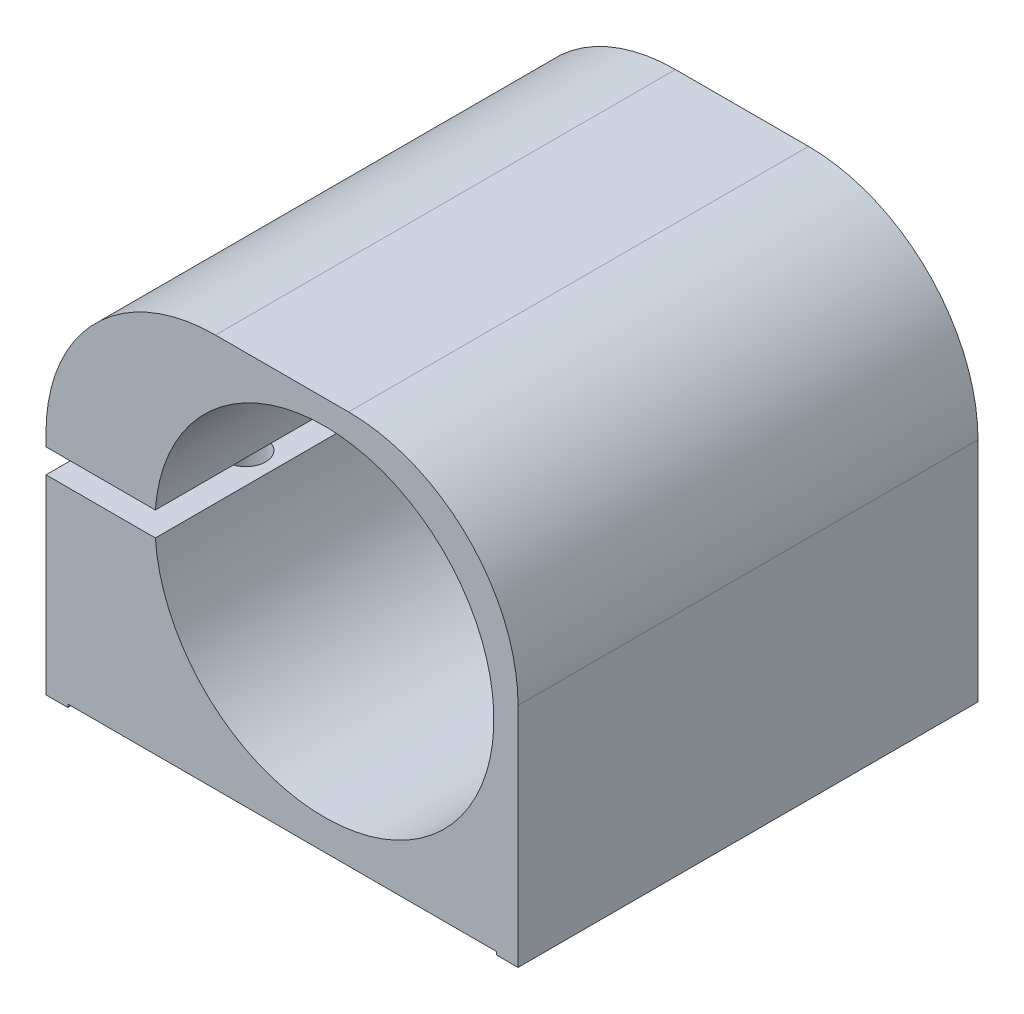
ISO-10303-21;
HEADER;
FILE_DESCRIPTION(('STEP AP214'),'2;1');
FILE_NAME('part.step','',(''),(''),'','','');
FILE_SCHEMA(('AUTOMOTIVE_DESIGN { 1 0 10303 214 1 1 1 1 }'));
ENDSEC;
DATA;
#1=APPLICATION_CONTEXT('core data for automotive mechanical design processes');
#2=APPLICATION_PROTOCOL_DEFINITION('international standard','automotive_design',2000,#1);
#3=PRODUCT_CONTEXT('',#1,'mechanical');
#4=PRODUCT('Part','Part','',(#3));
#5=PRODUCT_RELATED_PRODUCT_CATEGORY('part','',(#4));
#6=PRODUCT_DEFINITION_FORMATION('','',#4);
#7=PRODUCT_DEFINITION_CONTEXT('part definition',#1,'design');
#8=PRODUCT_DEFINITION('design','',#6,#7);
#9=PRODUCT_DEFINITION_SHAPE('','',#8);
#10=(LENGTH_UNIT() NAMED_UNIT(*) SI_UNIT(.MILLI.,.METRE.));
#11=(NAMED_UNIT(*) PLANE_ANGLE_UNIT() SI_UNIT($,.RADIAN.));
#12=(NAMED_UNIT(*) SI_UNIT($,.STERADIAN.) SOLID_ANGLE_UNIT());
#13=UNCERTAINTY_MEASURE_WITH_UNIT(LENGTH_MEASURE(1.E-05),#10,'distance_accuracy_value','');
#14=(GEOMETRIC_REPRESENTATION_CONTEXT(3) GLOBAL_UNCERTAINTY_ASSIGNED_CONTEXT((#13)) GLOBAL_UNIT_ASSIGNED_CONTEXT((#10,
#11,#12)) REPRESENTATION_CONTEXT('',''));
#15=CARTESIAN_POINT('',(0.,0.,0.));
#16=DIRECTION('',(0.,0.,1.));
#17=DIRECTION('',(1.,0.,0.));
#18=AXIS2_PLACEMENT_3D('',#15,#16,#17);
#19=CARTESIAN_POINT('',(-23.,0.,19.));
#20=DIRECTION('',(1.,0.,0.));
#21=DIRECTION('',(0.,1.,0.));
#22=AXIS2_PLACEMENT_3D('',#19,#20,#21);
#23=PLANE('',#22);
#24=DIRECTION('',(0.,0.,-1.));
#25=VECTOR('',#24,1.);
#26=CARTESIAN_POINT('',(-23.,-16.75,19.));
#27=LINE('',#26,#25);
#28=CARTESIAN_POINT('',(-23.,-16.75,19.));
#29=VERTEX_POINT('',#28);
#30=CARTESIAN_POINT('',(-23.,-16.75,-19.));
#31=VERTEX_POINT('',#30);
#32=EDGE_CURVE('E365',#29,#31,#27,.T.);
#33=ORIENTED_EDGE('',*,*,#32,.F.);
#34=DIRECTION('',(0.,-1.,0.));
#35=VECTOR('',#34,1.);
#36=CARTESIAN_POINT('',(-23.,0.,19.));
#37=LINE('',#36,#35);
#38=CARTESIAN_POINT('',(-23.,-1.,19.));
#39=VERTEX_POINT('',#38);
#40=EDGE_CURVE('E262',#39,#29,#37,.T.);
#41=ORIENTED_EDGE('',*,*,#40,.F.);
#42=DIRECTION('',(0.,0.,-1.));
#43=VECTOR('',#42,1.);
#44=CARTESIAN_POINT('',(-23.,-1.,19.));
#45=LINE('',#44,#43);
#46=CARTESIAN_POINT('',(-23.,-1.,-19.));
#47=VERTEX_POINT('',#46);
#48=EDGE_CURVE('E314',#39,#47,#45,.T.);
#49=ORIENTED_EDGE('',*,*,#48,.T.);
#50=DIRECTION('',(0.,-1.,0.));
#51=VECTOR('',#50,1.);
#52=CARTESIAN_POINT('',(-23.,0.,-19.));
#53=LINE('',#52,#51);
#54=EDGE_CURVE('E291',#47,#31,#53,.T.);
#55=ORIENTED_EDGE('',*,*,#54,.T.);
#56=EDGE_LOOP('',(#33,#41,#49,#55));
#57=FACE_BOUND('',#56,.T.);
#58=ADVANCED_FACE('F46',(#57),#23,.F.);
#59=CARTESIAN_POINT('',(16.,0.,19.));
#60=DIRECTION('',(-1.,0.,0.));
#61=DIRECTION('',(0.,-1.,0.));
#62=AXIS2_PLACEMENT_3D('',#59,#60,#61);
#63=PLANE('',#62);
#64=DIRECTION('',(0.,0.,1.));
#65=VECTOR('',#64,1.);
#66=CARTESIAN_POINT('',(16.,-16.75,19.));
#67=LINE('',#66,#65);
#68=CARTESIAN_POINT('',(16.,-16.75,-19.));
#69=VERTEX_POINT('',#68);
#70=CARTESIAN_POINT('',(16.,-16.75,19.));
#71=VERTEX_POINT('',#70);
#72=EDGE_CURVE('E372',#69,#71,#67,.T.);
#73=ORIENTED_EDGE('',*,*,#72,.F.);
#74=DIRECTION('',(0.,1.,0.));
#75=VECTOR('',#74,1.);
#76=CARTESIAN_POINT('',(16.,0.,-19.));
#77=LINE('',#76,#75);
#78=CARTESIAN_POINT('',(16.,2.,-19.));
#79=VERTEX_POINT('',#78);
#80=EDGE_CURVE('E173',#69,#79,#77,.T.);
#81=ORIENTED_EDGE('',*,*,#80,.T.);
#82=DIRECTION('',(0.,0.,-1.));
#83=VECTOR('',#82,1.);
#84=CARTESIAN_POINT('',(16.,2.,19.));
#85=LINE('',#84,#83);
#86=CARTESIAN_POINT('',(16.,2.,19.));
#87=VERTEX_POINT('',#86);
#88=EDGE_CURVE('E310',#87,#79,#85,.T.);
#89=ORIENTED_EDGE('',*,*,#88,.F.);
#90=DIRECTION('',(0.,1.,0.));
#91=VECTOR('',#90,1.);
#92=CARTESIAN_POINT('',(16.,0.,19.));
#93=LINE('',#92,#91);
#94=EDGE_CURVE('E273',#71,#87,#93,.T.);
#95=ORIENTED_EDGE('',*,*,#94,.F.);
#96=EDGE_LOOP('',(#73,#81,#89,#95));
#97=FACE_BOUND('',#96,.T.);
#98=ADVANCED_FACE('F423',(#97),#63,.F.);
#99=CARTESIAN_POINT('',(0.,0.,19.));
#100=DIRECTION('',(0.,0.,1.));
#101=DIRECTION('',(1.,0.,0.));
#102=AXIS2_PLACEMENT_3D('',#99,#100,#101);
#103=PLANE('',#102);
#104=ORIENTED_EDGE('',*,*,#40,.T.);
#105=DIRECTION('',(1.,0.,0.));
#106=VECTOR('',#105,1.);
#107=CARTESIAN_POINT('',(0.,-16.75,19.));
#108=LINE('',#107,#106);
#109=CARTESIAN_POINT('',(-21.2,-16.75,19.));
#110=VERTEX_POINT('',#109);
#111=EDGE_CURVE('E368',#29,#110,#108,.T.);
#112=ORIENTED_EDGE('',*,*,#111,.T.);
#113=DIRECTION('',(0.,-1.,0.));
#114=VECTOR('',#113,1.);
#115=CARTESIAN_POINT('',(-21.2,-16.5,19.));
#116=LINE('',#115,#114);
#117=CARTESIAN_POINT('',(-21.2,-16.5,19.));
#118=VERTEX_POINT('',#117);
#119=EDGE_CURVE('E186',#118,#110,#116,.T.);
#120=ORIENTED_EDGE('',*,*,#119,.F.);
#121=DIRECTION('',(-1.,0.,0.));
#122=VECTOR('',#121,1.);
#123=CARTESIAN_POINT('',(-21.2,-16.5,19.));
#124=LINE('',#123,#122);
#125=CARTESIAN_POINT('',(14.2,-16.5,19.));
#126=VERTEX_POINT('',#125);
#127=EDGE_CURVE('E189',#126,#118,#124,.T.);
#128=ORIENTED_EDGE('',*,*,#127,.F.);
#129=DIRECTION('',(0.,-1.,0.));
#130=VECTOR('',#129,1.);
#131=CARTESIAN_POINT('',(14.2,-16.5,19.));
#132=LINE('',#131,#130);
#133=CARTESIAN_POINT('',(14.2,-16.75,19.));
#134=VERTEX_POINT('',#133);
#135=EDGE_CURVE('E181',#126,#134,#132,.T.);
#136=ORIENTED_EDGE('',*,*,#135,.T.);
#137=EDGE_CURVE('E69',#134,#71,#108,.T.);
#138=ORIENTED_EDGE('',*,*,#137,.T.);
#139=ORIENTED_EDGE('',*,*,#94,.T.);
#140=CARTESIAN_POINT('',(2.,2.,19.));
#141=DIRECTION('',(0.,0.,1.));
#142=DIRECTION('',(1.,0.,0.));
#143=AXIS2_PLACEMENT_3D('',#140,#141,#142);
#144=CIRCLE('',#143,14.);
#145=CARTESIAN_POINT('',(2.,16.,19.));
#146=VERTEX_POINT('',#145);
#147=EDGE_CURVE('E276',#87,#146,#144,.T.);
#148=ORIENTED_EDGE('',*,*,#147,.T.);
#149=DIRECTION('',(-1.,0.,0.));
#150=VECTOR('',#149,1.);
#151=CARTESIAN_POINT('',(0.,16.,19.));
#152=LINE('',#151,#150);
#153=CARTESIAN_POINT('',(-9.,16.,19.));
#154=VERTEX_POINT('',#153);
#155=EDGE_CURVE('E250',#146,#154,#152,.T.);
#156=ORIENTED_EDGE('',*,*,#155,.T.);
#157=CARTESIAN_POINT('',(-9.,2.,19.));
#158=DIRECTION('',(0.,0.,1.));
#159=DIRECTION('',(1.,0.,0.));
#160=AXIS2_PLACEMENT_3D('',#157,#158,#159);
#161=CIRCLE('',#160,14.);
#162=CARTESIAN_POINT('',(-23.,2.,19.));
#163=VERTEX_POINT('',#162);
#164=EDGE_CURVE('E254',#154,#163,#161,.T.);
#165=ORIENTED_EDGE('',*,*,#164,.T.);
#166=CARTESIAN_POINT('',(-23.,1.,19.));
#167=VERTEX_POINT('',#166);
#168=EDGE_CURVE('E258',#163,#167,#37,.T.);
#169=ORIENTED_EDGE('',*,*,#168,.T.);
#170=DIRECTION('',(1.,0.,0.));
#171=VECTOR('',#170,1.);
#172=CARTESIAN_POINT('',(0.,1.,19.));
#173=LINE('',#172,#171);
#174=CARTESIAN_POINT('',(-13.9642400437689,1.,19.));
#175=VERTEX_POINT('',#174);
#176=EDGE_CURVE('E261',#167,#175,#173,.T.);
#177=ORIENTED_EDGE('',*,*,#176,.T.);
#178=CARTESIAN_POINT('',(0.,0.,19.));
#179=DIRECTION('',(0.,0.,1.));
#180=DIRECTION('',(1.,0.,0.));
#181=AXIS2_PLACEMENT_3D('',#178,#179,#180);
#182=CIRCLE('',#181,14.);
#183=CARTESIAN_POINT('',(-13.9642400437689,-1.,19.));
#184=VERTEX_POINT('',#183);
#185=EDGE_CURVE('E265',#184,#175,#182,.T.);
#186=ORIENTED_EDGE('',*,*,#185,.F.);
#187=DIRECTION('',(1.,0.,0.));
#188=VECTOR('',#187,1.);
#189=CARTESIAN_POINT('',(0.,-1.,19.));
#190=LINE('',#189,#188);
#191=EDGE_CURVE('E269',#39,#184,#190,.T.);
#192=ORIENTED_EDGE('',*,*,#191,.F.);
#193=EDGE_LOOP('',(#104,#112,#120,#128,#136,#138,#139,#148,#156,#165,#169,#177,#186,#192));
#194=FACE_BOUND('',#193,.T.);
#195=ADVANCED_FACE('F382',(#194),#103,.T.);
#196=CARTESIAN_POINT('',(0.,0.,-19.));
#197=DIRECTION('',(0.,0.,1.));
#198=DIRECTION('',(1.,0.,0.));
#199=AXIS2_PLACEMENT_3D('',#196,#197,#198);
#200=PLANE('',#199);
#201=DIRECTION('',(1.,0.,0.));
#202=VECTOR('',#201,1.);
#203=CARTESIAN_POINT('',(0.,-16.75,-19.));
#204=LINE('',#203,#202);
#205=CARTESIAN_POINT('',(-21.2,-16.75,-19.));
#206=VERTEX_POINT('',#205);
#207=EDGE_CURVE('E62',#31,#206,#204,.T.);
#208=ORIENTED_EDGE('',*,*,#207,.F.);
#209=ORIENTED_EDGE('',*,*,#54,.F.);
#210=DIRECTION('',(1.,0.,0.));
#211=VECTOR('',#210,1.);
#212=CARTESIAN_POINT('',(0.,-1.,-19.));
#213=LINE('',#212,#211);
#214=CARTESIAN_POINT('',(-13.9642400437689,-1.,-19.));
#215=VERTEX_POINT('',#214);
#216=EDGE_CURVE('E299',#47,#215,#213,.T.);
#217=ORIENTED_EDGE('',*,*,#216,.T.);
#218=CARTESIAN_POINT('',(0.,0.,-19.));
#219=DIRECTION('',(0.,0.,1.));
#220=DIRECTION('',(1.,0.,0.));
#221=AXIS2_PLACEMENT_3D('',#218,#219,#220);
#222=CIRCLE('',#221,14.);
#223=CARTESIAN_POINT('',(-13.9642400437689,1.,-19.));
#224=VERTEX_POINT('',#223);
#225=EDGE_CURVE('E295',#215,#224,#222,.T.);
#226=ORIENTED_EDGE('',*,*,#225,.T.);
#227=DIRECTION('',(1.,0.,0.));
#228=VECTOR('',#227,1.);
#229=CARTESIAN_POINT('',(0.,1.,-19.));
#230=LINE('',#229,#228);
#231=CARTESIAN_POINT('',(-23.,1.,-19.));
#232=VERTEX_POINT('',#231);
#233=EDGE_CURVE('E290',#232,#224,#230,.T.);
#234=ORIENTED_EDGE('',*,*,#233,.F.);
#235=CARTESIAN_POINT('',(-23.,2.,-19.));
#236=VERTEX_POINT('',#235);
#237=EDGE_CURVE('E287',#236,#232,#53,.T.);
#238=ORIENTED_EDGE('',*,*,#237,.F.);
#239=CARTESIAN_POINT('',(-9.,2.,-19.));
#240=DIRECTION('',(0.,0.,1.));
#241=DIRECTION('',(1.,0.,0.));
#242=AXIS2_PLACEMENT_3D('',#239,#240,#241);
#243=CIRCLE('',#242,14.);
#244=CARTESIAN_POINT('',(-9.,16.,-19.));
#245=VERTEX_POINT('',#244);
#246=EDGE_CURVE('E284',#245,#236,#243,.T.);
#247=ORIENTED_EDGE('',*,*,#246,.F.);
#248=DIRECTION('',(-1.,0.,0.));
#249=VECTOR('',#248,1.);
#250=CARTESIAN_POINT('',(0.,16.,-19.));
#251=LINE('',#250,#249);
#252=CARTESIAN_POINT('',(2.,16.,-19.));
#253=VERTEX_POINT('',#252);
#254=EDGE_CURVE('E280',#253,#245,#251,.T.);
#255=ORIENTED_EDGE('',*,*,#254,.F.);
#256=CARTESIAN_POINT('',(2.,2.,-19.));
#257=DIRECTION('',(0.,0.,1.));
#258=DIRECTION('',(1.,0.,0.));
#259=AXIS2_PLACEMENT_3D('',#256,#257,#258);
#260=CIRCLE('',#259,14.);
#261=EDGE_CURVE('E255',#79,#253,#260,.T.);
#262=ORIENTED_EDGE('',*,*,#261,.F.);
#263=ORIENTED_EDGE('',*,*,#80,.F.);
#264=CARTESIAN_POINT('',(14.2,-16.75,-19.));
#265=VERTEX_POINT('',#264);
#266=EDGE_CURVE('E161',#265,#69,#204,.T.);
#267=ORIENTED_EDGE('',*,*,#266,.F.);
#268=DIRECTION('',(0.,-1.,0.));
#269=VECTOR('',#268,1.);
#270=CARTESIAN_POINT('',(14.2,-16.5,-19.));
#271=LINE('',#270,#269);
#272=CARTESIAN_POINT('',(14.2,-16.5,-19.));
#273=VERTEX_POINT('',#272);
#274=EDGE_CURVE('E171',#273,#265,#271,.T.);
#275=ORIENTED_EDGE('',*,*,#274,.F.);
#276=DIRECTION('',(1.,0.,0.));
#277=VECTOR('',#276,1.);
#278=CARTESIAN_POINT('',(-21.2,-16.5,-19.));
#279=LINE('',#278,#277);
#280=CARTESIAN_POINT('',(-21.2,-16.5,-19.));
#281=VERTEX_POINT('',#280);
#282=EDGE_CURVE('E359',#281,#273,#279,.T.);
#283=ORIENTED_EDGE('',*,*,#282,.F.);
#284=DIRECTION('',(0.,-1.,0.));
#285=VECTOR('',#284,1.);
#286=CARTESIAN_POINT('',(-21.2,-16.5,-19.));
#287=LINE('',#286,#285);
#288=EDGE_CURVE('E182',#281,#206,#287,.T.);
#289=ORIENTED_EDGE('',*,*,#288,.T.);
#290=EDGE_LOOP('',(#208,#209,#217,#226,#234,#238,#247,#255,#262,#263,#267,#275,#283,#289));
#291=FACE_BOUND('',#290,.T.);
#292=ADVANCED_FACE('F169',(#291),#200,.F.);
#293=CARTESIAN_POINT('',(-21.2,-16.5,19.));
#294=DIRECTION('',(-1.,0.,0.));
#295=DIRECTION('',(0.,0.,1.));
#296=AXIS2_PLACEMENT_3D('',#293,#294,#295);
#297=PLANE('',#296);
#298=DIRECTION('',(0.,0.,1.));
#299=VECTOR('',#298,1.);
#300=CARTESIAN_POINT('',(-21.2,-16.75,19.));
#301=LINE('',#300,#299);
#302=EDGE_CURVE('E369',#206,#110,#301,.T.);
#303=ORIENTED_EDGE('',*,*,#302,.F.);
#304=ORIENTED_EDGE('',*,*,#288,.F.);
#305=DIRECTION('',(0.,0.,-1.));
#306=VECTOR('',#305,1.);
#307=CARTESIAN_POINT('',(-21.2,-16.5,19.));
#308=LINE('',#307,#306);
#309=EDGE_CURVE('E362',#118,#281,#308,.T.);
#310=ORIENTED_EDGE('',*,*,#309,.F.);
#311=ORIENTED_EDGE('',*,*,#119,.T.);
#312=EDGE_LOOP('',(#303,#304,#310,#311));
#313=FACE_BOUND('',#312,.T.);
#314=ADVANCED_FACE('F474',(#313),#297,.F.);
#315=CARTESIAN_POINT('',(14.2,-16.5,19.));
#316=DIRECTION('',(1.,0.,0.));
#317=DIRECTION('',(0.,0.,-1.));
#318=AXIS2_PLACEMENT_3D('',#315,#316,#317);
#319=PLANE('',#318);
#320=DIRECTION('',(0.,0.,-1.));
#321=VECTOR('',#320,1.);
#322=CARTESIAN_POINT('',(14.2,-16.75,19.));
#323=LINE('',#322,#321);
#324=EDGE_CURVE('E12',#134,#265,#323,.T.);
#325=ORIENTED_EDGE('',*,*,#324,.F.);
#326=ORIENTED_EDGE('',*,*,#135,.F.);
#327=DIRECTION('',(0.,0.,1.));
#328=VECTOR('',#327,1.);
#329=CARTESIAN_POINT('',(14.2,-16.5,19.));
#330=LINE('',#329,#328);
#331=EDGE_CURVE('E178',#273,#126,#330,.T.);
#332=ORIENTED_EDGE('',*,*,#331,.F.);
#333=ORIENTED_EDGE('',*,*,#274,.T.);
#334=EDGE_LOOP('',(#325,#326,#332,#333));
#335=FACE_BOUND('',#334,.T.);
#336=ADVANCED_FACE('F176',(#335),#319,.F.);
#337=CARTESIAN_POINT('',(-16.5,-17.,9.));
#338=DIRECTION('',(0.,-1.,0.));
#339=DIRECTION('',(0.,0.,-1.));
#340=AXIS2_PLACEMENT_3D('',#337,#338,#339);
#341=CYLINDRICAL_SURFACE('',#340,3.25);
#342=CARTESIAN_POINT('',(-16.5,-13.6,9.));
#343=DIRECTION('',(0.,-1.,0.));
#344=DIRECTION('',(0.,0.,-1.));
#345=AXIS2_PLACEMENT_3D('',#342,#343,#344);
#346=CIRCLE('',#345,3.25);
#347=CARTESIAN_POINT('',(-16.5,-13.6,5.75));
#348=VERTEX_POINT('',#347);
#349=EDGE_CURVE('E245',#348,#348,#346,.T.);
#350=ORIENTED_EDGE('',*,*,#349,.F.);
#351=EDGE_LOOP('',(#350));
#352=FACE_BOUND('',#351,.T.);
#353=CARTESIAN_POINT('',(-16.5,-16.5,9.));
#354=DIRECTION('',(0.,-1.,0.));
#355=DIRECTION('',(0.,0.,-1.));
#356=AXIS2_PLACEMENT_3D('',#353,#354,#355);
#357=CIRCLE('',#356,3.25);
#358=CARTESIAN_POINT('',(-16.5,-16.5,5.75));
#359=VERTEX_POINT('',#358);
#360=EDGE_CURVE('E206',#359,#359,#357,.F.);
#361=ORIENTED_EDGE('',*,*,#360,.F.);
#362=EDGE_LOOP('',(#361));
#363=FACE_BOUND('',#362,.T.);
#364=ADVANCED_FACE('F451',(#352,#363),#341,.F.);
#365=CARTESIAN_POINT('',(-16.5,-17.,-9.));
#366=DIRECTION('',(0.,-1.,0.));
#367=DIRECTION('',(0.,0.,-1.));
#368=AXIS2_PLACEMENT_3D('',#365,#366,#367);
#369=CYLINDRICAL_SURFACE('',#368,3.25);
#370=CARTESIAN_POINT('',(-16.5,-13.6,-9.));
#371=DIRECTION('',(0.,-1.,0.));
#372=DIRECTION('',(0.,0.,-1.));
#373=AXIS2_PLACEMENT_3D('',#370,#371,#372);
#374=CIRCLE('',#373,3.25);
#375=CARTESIAN_POINT('',(-16.5,-13.6,-12.25));
#376=VERTEX_POINT('',#375);
#377=EDGE_CURVE('E236',#376,#376,#374,.T.);
#378=ORIENTED_EDGE('',*,*,#377,.F.);
#379=EDGE_LOOP('',(#378));
#380=FACE_BOUND('',#379,.T.);
#381=CARTESIAN_POINT('',(-16.5,-16.5,-9.));
#382=DIRECTION('',(0.,-1.,0.));
#383=DIRECTION('',(0.,0.,-1.));
#384=AXIS2_PLACEMENT_3D('',#381,#382,#383);
#385=CIRCLE('',#384,3.25);
#386=CARTESIAN_POINT('',(-16.5,-16.5,-12.25));
#387=VERTEX_POINT('',#386);
#388=EDGE_CURVE('E202',#387,#387,#385,.F.);
#389=ORIENTED_EDGE('',*,*,#388,.F.);
#390=EDGE_LOOP('',(#389));
#391=FACE_BOUND('',#390,.T.);
#392=ADVANCED_FACE('F447',(#380,#391),#369,.F.);
#393=CARTESIAN_POINT('',(0.,16.,19.));
#394=DIRECTION('',(0.,-1.,0.));
#395=DIRECTION('',(0.,0.,-1.));
#396=AXIS2_PLACEMENT_3D('',#393,#394,#395);
#397=PLANE('',#396);
#398=ORIENTED_EDGE('',*,*,#254,.T.);
#399=DIRECTION('',(0.,0.,-1.));
#400=VECTOR('',#399,1.);
#401=CARTESIAN_POINT('',(-9.,16.,19.));
#402=LINE('',#401,#400);
#403=EDGE_CURVE('E55',#154,#245,#402,.T.);
#404=ORIENTED_EDGE('',*,*,#403,.F.);
#405=ORIENTED_EDGE('',*,*,#155,.F.);
#406=DIRECTION('',(0.,0.,-1.));
#407=VECTOR('',#406,1.);
#408=CARTESIAN_POINT('',(2.,16.,19.));
#409=LINE('',#408,#407);
#410=EDGE_CURVE('E279',#146,#253,#409,.T.);
#411=ORIENTED_EDGE('',*,*,#410,.T.);
#412=EDGE_LOOP('',(#398,#404,#405,#411));
#413=FACE_BOUND('',#412,.T.);
#414=ADVANCED_FACE('F48',(#413),#397,.F.);
#415=CARTESIAN_POINT('',(-9.,2.,19.));
#416=DIRECTION('',(0.,0.,-1.));
#417=DIRECTION('',(-1.,0.,0.));
#418=AXIS2_PLACEMENT_3D('',#415,#416,#417);
#419=CYLINDRICAL_SURFACE('',#418,14.);
#420=ORIENTED_EDGE('',*,*,#246,.T.);
#421=DIRECTION('',(0.,0.,-1.));
#422=VECTOR('',#421,1.);
#423=CARTESIAN_POINT('',(-23.,2.,19.));
#424=LINE('',#423,#422);
#425=EDGE_CURVE('E327',#163,#236,#424,.T.);
#426=ORIENTED_EDGE('',*,*,#425,.F.);
#427=ORIENTED_EDGE('',*,*,#164,.F.);
#428=ORIENTED_EDGE('',*,*,#403,.T.);
#429=EDGE_LOOP('',(#420,#426,#427,#428));
#430=FACE_BOUND('',#429,.T.);
#431=ADVANCED_FACE('F412',(#430),#419,.T.);
#432=ORIENTED_EDGE('',*,*,#237,.T.);
#433=DIRECTION('',(0.,0.,-1.));
#434=VECTOR('',#433,1.);
#435=CARTESIAN_POINT('',(-23.,1.,19.));
#436=LINE('',#435,#434);
#437=EDGE_CURVE('E323',#167,#232,#436,.T.);
#438=ORIENTED_EDGE('',*,*,#437,.F.);
#439=ORIENTED_EDGE('',*,*,#168,.F.);
#440=ORIENTED_EDGE('',*,*,#425,.T.);
#441=EDGE_LOOP('',(#432,#438,#439,#440));
#442=FACE_BOUND('',#441,.T.);
#443=ADVANCED_FACE('F409',(#442),#23,.F.);
#444=CARTESIAN_POINT('',(0.,1.,19.));
#445=DIRECTION('',(0.,1.,0.));
#446=DIRECTION('',(0.,0.,1.));
#447=AXIS2_PLACEMENT_3D('',#444,#445,#446);
#448=PLANE('',#447);
#449=CARTESIAN_POINT('',(-16.5,1.,-9.));
#450=DIRECTION('',(0.,1.,0.));
#451=DIRECTION('',(0.,0.,1.));
#452=AXIS2_PLACEMENT_3D('',#449,#450,#451);
#453=CIRCLE('',#452,1.25);
#454=CARTESIAN_POINT('',(-16.5,1.,-7.75));
#455=VERTEX_POINT('',#454);
#456=EDGE_CURVE('E226',#455,#455,#453,.T.);
#457=ORIENTED_EDGE('',*,*,#456,.T.);
#458=EDGE_LOOP('',(#457));
#459=FACE_BOUND('',#458,.T.);
#460=CARTESIAN_POINT('',(-16.5,1.,9.));
#461=DIRECTION('',(0.,1.,0.));
#462=DIRECTION('',(0.,0.,1.));
#463=AXIS2_PLACEMENT_3D('',#460,#461,#462);
#464=CIRCLE('',#463,1.25);
#465=CARTESIAN_POINT('',(-16.5,1.,10.25));
#466=VERTEX_POINT('',#465);
#467=EDGE_CURVE('E231',#466,#466,#464,.T.);
#468=ORIENTED_EDGE('',*,*,#467,.T.);
#469=EDGE_LOOP('',(#468));
#470=FACE_BOUND('',#469,.T.);
#471=ORIENTED_EDGE('',*,*,#233,.T.);
#472=DIRECTION('',(0.,0.,-1.));
#473=VECTOR('',#472,1.);
#474=CARTESIAN_POINT('',(-13.9642400437689,1.,19.));
#475=LINE('',#474,#473);
#476=EDGE_CURVE('E320',#175,#224,#475,.T.);
#477=ORIENTED_EDGE('',*,*,#476,.F.);
#478=ORIENTED_EDGE('',*,*,#176,.F.);
#479=ORIENTED_EDGE('',*,*,#437,.T.);
#480=EDGE_LOOP('',(#471,#477,#478,#479));
#481=FACE_BOUND('',#480,.T.);
#482=ADVANCED_FACE('F404',(#459,#470,#481),#448,.F.);
#483=CARTESIAN_POINT('',(0.,0.,19.));
#484=DIRECTION('',(0.,0.,-1.));
#485=DIRECTION('',(-1.,0.,0.));
#486=AXIS2_PLACEMENT_3D('',#483,#484,#485);
#487=CYLINDRICAL_SURFACE('',#486,14.);
#488=ORIENTED_EDGE('',*,*,#225,.F.);
#489=DIRECTION('',(0.,0.,-1.));
#490=VECTOR('',#489,1.);
#491=CARTESIAN_POINT('',(-13.9642400437689,-1.,19.));
#492=LINE('',#491,#490);
#493=EDGE_CURVE('E317',#184,#215,#492,.T.);
#494=ORIENTED_EDGE('',*,*,#493,.F.);
#495=ORIENTED_EDGE('',*,*,#185,.T.);
#496=ORIENTED_EDGE('',*,*,#476,.T.);
#497=EDGE_LOOP('',(#488,#494,#495,#496));
#498=FACE_BOUND('',#497,.T.);
#499=ADVANCED_FACE('F399',(#498),#487,.F.);
#500=CARTESIAN_POINT('',(0.,-1.,19.));
#501=DIRECTION('',(0.,1.,0.));
#502=DIRECTION('',(-1.,0.,0.));
#503=AXIS2_PLACEMENT_3D('',#500,#501,#502);
#504=PLANE('',#503);
#505=CARTESIAN_POINT('',(-16.5,-1.,-9.));
#506=DIRECTION('',(0.,1.,0.));
#507=DIRECTION('',(-1.,0.,0.));
#508=AXIS2_PLACEMENT_3D('',#505,#506,#507);
#509=CIRCLE('',#508,1.65);
#510=CARTESIAN_POINT('',(-18.15,-1.,-9.));
#511=VERTEX_POINT('',#510);
#512=EDGE_CURVE('E240',#511,#511,#509,.T.);
#513=ORIENTED_EDGE('',*,*,#512,.F.);
#514=EDGE_LOOP('',(#513));
#515=FACE_BOUND('',#514,.T.);
#516=CARTESIAN_POINT('',(-16.5,-1.,9.));
#517=DIRECTION('',(0.,1.,0.));
#518=DIRECTION('',(-1.,0.,0.));
#519=AXIS2_PLACEMENT_3D('',#516,#517,#518);
#520=CIRCLE('',#519,1.65);
#521=CARTESIAN_POINT('',(-18.15,-1.,9.));
#522=VERTEX_POINT('',#521);
#523=EDGE_CURVE('E249',#522,#522,#520,.T.);
#524=ORIENTED_EDGE('',*,*,#523,.F.);
#525=EDGE_LOOP('',(#524));
#526=FACE_BOUND('',#525,.T.);
#527=ORIENTED_EDGE('',*,*,#216,.F.);
#528=ORIENTED_EDGE('',*,*,#48,.F.);
#529=ORIENTED_EDGE('',*,*,#191,.T.);
#530=ORIENTED_EDGE('',*,*,#493,.T.);
#531=EDGE_LOOP('',(#527,#528,#529,#530));
#532=FACE_BOUND('',#531,.T.);
#533=ADVANCED_FACE('F395',(#515,#526,#532),#504,.T.);
#534=CARTESIAN_POINT('',(2.,2.,19.));
#535=DIRECTION('',(0.,0.,-1.));
#536=DIRECTION('',(-1.,0.,0.));
#537=AXIS2_PLACEMENT_3D('',#534,#535,#536);
#538=CYLINDRICAL_SURFACE('',#537,14.);
#539=ORIENTED_EDGE('',*,*,#261,.T.);
#540=ORIENTED_EDGE('',*,*,#410,.F.);
#541=ORIENTED_EDGE('',*,*,#147,.F.);
#542=ORIENTED_EDGE('',*,*,#88,.T.);
#543=EDGE_LOOP('',(#539,#540,#541,#542));
#544=FACE_BOUND('',#543,.T.);
#545=ADVANCED_FACE('F420',(#544),#538,.T.);
#546=CARTESIAN_POINT('',(-16.5,-17.,9.));
#547=DIRECTION('',(0.,-1.,0.));
#548=DIRECTION('',(0.,0.,-1.));
#549=AXIS2_PLACEMENT_3D('',#546,#547,#548);
#550=CYLINDRICAL_SURFACE('',#549,1.65);
#551=ORIENTED_EDGE('',*,*,#523,.T.);
#552=EDGE_LOOP('',(#551));
#553=FACE_BOUND('',#552,.T.);
#554=CARTESIAN_POINT('',(-16.5,-13.6,9.));
#555=DIRECTION('',(0.,-1.,0.));
#556=DIRECTION('',(0.,0.,-1.));
#557=AXIS2_PLACEMENT_3D('',#554,#555,#556);
#558=CIRCLE('',#557,1.65);
#559=CARTESIAN_POINT('',(-16.5,-13.6,7.35));
#560=VERTEX_POINT('',#559);
#561=EDGE_CURVE('E241',#560,#560,#558,.T.);
#562=ORIENTED_EDGE('',*,*,#561,.T.);
#563=EDGE_LOOP('',(#562));
#564=FACE_BOUND('',#563,.T.);
#565=ADVANCED_FACE('F465',(#553,#564),#550,.F.);
#566=CARTESIAN_POINT('',(-14.85,-13.6,9.));
#567=DIRECTION('',(0.,1.,0.));
#568=DIRECTION('',(0.,0.,1.));
#569=AXIS2_PLACEMENT_3D('',#566,#567,#568);
#570=PLANE('',#569);
#571=ORIENTED_EDGE('',*,*,#561,.F.);
#572=EDGE_LOOP('',(#571));
#573=FACE_BOUND('',#572,.T.);
#574=ORIENTED_EDGE('',*,*,#349,.T.);
#575=EDGE_LOOP('',(#574));
#576=FACE_BOUND('',#575,.T.);
#577=ADVANCED_FACE('F468',(#573,#576),#570,.F.);
#578=CARTESIAN_POINT('',(-16.5,-17.,-9.));
#579=DIRECTION('',(0.,-1.,0.));
#580=DIRECTION('',(0.,0.,-1.));
#581=AXIS2_PLACEMENT_3D('',#578,#579,#580);
#582=CYLINDRICAL_SURFACE('',#581,1.65);
#583=ORIENTED_EDGE('',*,*,#512,.T.);
#584=EDGE_LOOP('',(#583));
#585=FACE_BOUND('',#584,.T.);
#586=CARTESIAN_POINT('',(-16.5,-13.6,-9.));
#587=DIRECTION('',(0.,-1.,0.));
#588=DIRECTION('',(0.,0.,-1.));
#589=AXIS2_PLACEMENT_3D('',#586,#587,#588);
#590=CIRCLE('',#589,1.65);
#591=CARTESIAN_POINT('',(-16.5,-13.6,-10.65));
#592=VERTEX_POINT('',#591);
#593=EDGE_CURVE('E232',#592,#592,#590,.T.);
#594=ORIENTED_EDGE('',*,*,#593,.T.);
#595=EDGE_LOOP('',(#594));
#596=FACE_BOUND('',#595,.T.);
#597=ADVANCED_FACE('F471',(#585,#596),#582,.F.);
#598=CARTESIAN_POINT('',(-14.85,-13.6,-9.));
#599=DIRECTION('',(0.,1.,0.));
#600=DIRECTION('',(0.,0.,1.));
#601=AXIS2_PLACEMENT_3D('',#598,#599,#600);
#602=PLANE('',#601);
#603=ORIENTED_EDGE('',*,*,#593,.F.);
#604=EDGE_LOOP('',(#603));
#605=FACE_BOUND('',#604,.T.);
#606=ORIENTED_EDGE('',*,*,#377,.T.);
#607=EDGE_LOOP('',(#606));
#608=FACE_BOUND('',#607,.T.);
#609=ADVANCED_FACE('F463',(#605,#608),#602,.F.);
#610=CARTESIAN_POINT('',(-16.5,-17.,9.));
#611=DIRECTION('',(0.,-1.,0.));
#612=DIRECTION('',(0.,0.,-1.));
#613=AXIS2_PLACEMENT_3D('',#610,#611,#612);
#614=CYLINDRICAL_SURFACE('',#613,1.25);
#615=CARTESIAN_POINT('',(-16.5,11.,9.));
#616=DIRECTION('',(0.,-1.,0.));
#617=DIRECTION('',(0.,0.,-1.));
#618=AXIS2_PLACEMENT_3D('',#615,#616,#617);
#619=CIRCLE('',#618,1.25);
#620=CARTESIAN_POINT('',(-16.5,11.,7.75));
#621=VERTEX_POINT('',#620);
#622=EDGE_CURVE('E227',#621,#621,#619,.T.);
#623=ORIENTED_EDGE('',*,*,#622,.F.);
#624=EDGE_LOOP('',(#623));
#625=FACE_BOUND('',#624,.T.);
#626=ORIENTED_EDGE('',*,*,#467,.F.);
#627=EDGE_LOOP('',(#626));
#628=FACE_BOUND('',#627,.T.);
#629=ADVANCED_FACE('F519',(#625,#628),#614,.F.);
#630=CARTESIAN_POINT('',(-16.5,11.,9.));
#631=DIRECTION('',(0.,-1.,0.));
#632=DIRECTION('',(0.,0.,-1.));
#633=AXIS2_PLACEMENT_3D('',#630,#631,#632);
#634=CONICAL_SURFACE('',#633,1.25,1.02974425867665);
#635=CARTESIAN_POINT('',(-16.5,11.7510757737844,9.));
#636=VERTEX_POINT('',#635);
#637=VERTEX_LOOP('',#636);
#638=FACE_BOUND('',#637,.T.);
#639=ORIENTED_EDGE('',*,*,#622,.T.);
#640=EDGE_LOOP('',(#639));
#641=FACE_BOUND('',#640,.T.);
#642=ADVANCED_FACE('F514',(#638,#641),#634,.F.);
#643=CARTESIAN_POINT('',(-16.5,-17.,-9.));
#644=DIRECTION('',(0.,-1.,0.));
#645=DIRECTION('',(0.,0.,-1.));
#646=AXIS2_PLACEMENT_3D('',#643,#644,#645);
#647=CYLINDRICAL_SURFACE('',#646,1.25);
#648=CARTESIAN_POINT('',(-16.5,11.,-9.));
#649=DIRECTION('',(0.,-1.,0.));
#650=DIRECTION('',(0.,0.,-1.));
#651=AXIS2_PLACEMENT_3D('',#648,#649,#650);
#652=CIRCLE('',#651,1.25);
#653=CARTESIAN_POINT('',(-16.5,11.,-10.25));
#654=VERTEX_POINT('',#653);
#655=EDGE_CURVE('E222',#654,#654,#652,.T.);
#656=ORIENTED_EDGE('',*,*,#655,.F.);
#657=EDGE_LOOP('',(#656));
#658=FACE_BOUND('',#657,.T.);
#659=ORIENTED_EDGE('',*,*,#456,.F.);
#660=EDGE_LOOP('',(#659));
#661=FACE_BOUND('',#660,.T.);
#662=ADVANCED_FACE('F510',(#658,#661),#647,.F.);
#663=CARTESIAN_POINT('',(-16.5,11.,-9.));
#664=DIRECTION('',(0.,-1.,0.));
#665=DIRECTION('',(0.,0.,-1.));
#666=AXIS2_PLACEMENT_3D('',#663,#664,#665);
#667=CONICAL_SURFACE('',#666,1.25,1.02974425867665);
#668=CARTESIAN_POINT('',(-16.5,11.7510757737844,-9.));
#669=VERTEX_POINT('',#668);
#670=VERTEX_LOOP('',#669);
#671=FACE_BOUND('',#670,.T.);
#672=ORIENTED_EDGE('',*,*,#655,.T.);
#673=EDGE_LOOP('',(#672));
#674=FACE_BOUND('',#673,.T.);
#675=ADVANCED_FACE('F513',(#671,#674),#667,.F.);
#676=CARTESIAN_POINT('',(0.,-16.5,0.));
#677=DIRECTION('',(0.,-1.,0.));
#678=DIRECTION('',(0.,0.,-1.));
#679=AXIS2_PLACEMENT_3D('',#676,#677,#678);
#680=PLANE('',#679);
#681=ORIENTED_EDGE('',*,*,#309,.T.);
#682=ORIENTED_EDGE('',*,*,#282,.T.);
#683=ORIENTED_EDGE('',*,*,#331,.T.);
#684=ORIENTED_EDGE('',*,*,#127,.T.);
#685=EDGE_LOOP('',(#681,#682,#683,#684));
#686=FACE_BOUND('',#685,.T.);
#687=CARTESIAN_POINT('',(-12.,-16.5,-14.));
#688=DIRECTION('',(0.,-1.,0.));
#689=DIRECTION('',(0.,0.,-1.));
#690=AXIS2_PLACEMENT_3D('',#687,#688,#689);
#691=CIRCLE('',#690,1.65);
#692=CARTESIAN_POINT('',(-12.,-16.5,-15.65));
#693=VERTEX_POINT('',#692);
#694=EDGE_CURVE('E198',#693,#693,#691,.F.);
#695=ORIENTED_EDGE('',*,*,#694,.T.);
#696=EDGE_LOOP('',(#695));
#697=FACE_BOUND('',#696,.T.);
#698=CARTESIAN_POINT('',(-12.,-16.5,14.));
#699=DIRECTION('',(0.,-1.,0.));
#700=DIRECTION('',(0.,0.,-1.));
#701=AXIS2_PLACEMENT_3D('',#698,#699,#700);
#702=CIRCLE('',#701,1.65);
#703=CARTESIAN_POINT('',(-12.,-16.5,12.35));
#704=VERTEX_POINT('',#703);
#705=EDGE_CURVE('E193',#704,#704,#702,.F.);
#706=ORIENTED_EDGE('',*,*,#705,.T.);
#707=EDGE_LOOP('',(#706));
#708=FACE_BOUND('',#707,.T.);
#709=CARTESIAN_POINT('',(12.,-16.5,0.));
#710=DIRECTION('',(0.,-1.,0.));
#711=DIRECTION('',(0.,0.,-1.));
#712=AXIS2_PLACEMENT_3D('',#709,#710,#711);
#713=CIRCLE('',#712,1.65);
#714=CARTESIAN_POINT('',(12.,-16.5,-1.65));
#715=VERTEX_POINT('',#714);
#716=EDGE_CURVE('E197',#715,#715,#713,.F.);
#717=ORIENTED_EDGE('',*,*,#716,.T.);
#718=EDGE_LOOP('',(#717));
#719=FACE_BOUND('',#718,.T.);
#720=ORIENTED_EDGE('',*,*,#388,.T.);
#721=EDGE_LOOP('',(#720));
#722=FACE_BOUND('',#721,.T.);
#723=ORIENTED_EDGE('',*,*,#360,.T.);
#724=EDGE_LOOP('',(#723));
#725=FACE_BOUND('',#724,.T.);
#726=ADVANCED_FACE('F502',(#686,#697,#708,#719,#722,#725),#680,.T.);
#727=CARTESIAN_POINT('',(-12.,-10.5,14.));
#728=DIRECTION('',(0.,-1.,0.));
#729=DIRECTION('',(0.,0.,-1.));
#730=AXIS2_PLACEMENT_3D('',#727,#728,#729);
#731=CONICAL_SURFACE('',#730,1.65,1.02974425867665);
#732=CARTESIAN_POINT('',(-12.,-9.50857997860453,14.));
#733=VERTEX_POINT('',#732);
#734=VERTEX_LOOP('',#733);
#735=FACE_BOUND('',#734,.T.);
#736=CARTESIAN_POINT('',(-12.,-10.5,14.));
#737=DIRECTION('',(0.,-1.,0.));
#738=DIRECTION('',(0.,0.,-1.));
#739=AXIS2_PLACEMENT_3D('',#736,#737,#738);
#740=CIRCLE('',#739,1.65);
#741=CARTESIAN_POINT('',(-12.,-10.5,12.35));
#742=VERTEX_POINT('',#741);
#743=EDGE_CURVE('E214',#742,#742,#740,.T.);
#744=ORIENTED_EDGE('',*,*,#743,.T.);
#745=EDGE_LOOP('',(#744));
#746=FACE_BOUND('',#745,.T.);
#747=ADVANCED_FACE('F498',(#735,#746),#731,.F.);
#748=CARTESIAN_POINT('',(-12.,-17.,14.));
#749=DIRECTION('',(0.,-1.,0.));
#750=DIRECTION('',(0.,0.,-1.));
#751=AXIS2_PLACEMENT_3D('',#748,#749,#750);
#752=CYLINDRICAL_SURFACE('',#751,1.65);
#753=ORIENTED_EDGE('',*,*,#743,.F.);
#754=EDGE_LOOP('',(#753));
#755=FACE_BOUND('',#754,.T.);
#756=ORIENTED_EDGE('',*,*,#705,.F.);
#757=EDGE_LOOP('',(#756));
#758=FACE_BOUND('',#757,.T.);
#759=ADVANCED_FACE('F494',(#755,#758),#752,.F.);
#760=CARTESIAN_POINT('',(12.,-10.5,0.));
#761=DIRECTION('',(0.,-1.,0.));
#762=DIRECTION('',(0.,0.,-1.));
#763=AXIS2_PLACEMENT_3D('',#760,#761,#762);
#764=CONICAL_SURFACE('',#763,1.65,1.02974425867665);
#765=CARTESIAN_POINT('',(12.,-9.50857997860453,0.));
#766=VERTEX_POINT('',#765);
#767=VERTEX_LOOP('',#766);
#768=FACE_BOUND('',#767,.T.);
#769=CARTESIAN_POINT('',(12.,-10.5,0.));
#770=DIRECTION('',(0.,-1.,0.));
#771=DIRECTION('',(0.,0.,-1.));
#772=AXIS2_PLACEMENT_3D('',#769,#770,#771);
#773=CIRCLE('',#772,1.65);
#774=CARTESIAN_POINT('',(12.,-10.5,-1.65));
#775=VERTEX_POINT('',#774);
#776=EDGE_CURVE('E218',#775,#775,#773,.T.);
#777=ORIENTED_EDGE('',*,*,#776,.T.);
#778=EDGE_LOOP('',(#777));
#779=FACE_BOUND('',#778,.T.);
#780=ADVANCED_FACE('F497',(#768,#779),#764,.F.);
#781=CARTESIAN_POINT('',(12.,-17.,0.));
#782=DIRECTION('',(0.,-1.,0.));
#783=DIRECTION('',(0.,0.,-1.));
#784=AXIS2_PLACEMENT_3D('',#781,#782,#783);
#785=CYLINDRICAL_SURFACE('',#784,1.65);
#786=ORIENTED_EDGE('',*,*,#776,.F.);
#787=EDGE_LOOP('',(#786));
#788=FACE_BOUND('',#787,.T.);
#789=ORIENTED_EDGE('',*,*,#716,.F.);
#790=EDGE_LOOP('',(#789));
#791=FACE_BOUND('',#790,.T.);
#792=ADVANCED_FACE('F492',(#788,#791),#785,.F.);
#793=CARTESIAN_POINT('',(-12.,-10.5,-14.));
#794=DIRECTION('',(0.,-1.,0.));
#795=DIRECTION('',(0.,0.,-1.));
#796=AXIS2_PLACEMENT_3D('',#793,#794,#795);
#797=CONICAL_SURFACE('',#796,1.65,1.02974425867665);
#798=CARTESIAN_POINT('',(-12.,-9.50857997860453,-14.));
#799=VERTEX_POINT('',#798);
#800=VERTEX_LOOP('',#799);
#801=FACE_BOUND('',#800,.T.);
#802=CARTESIAN_POINT('',(-12.,-10.5,-14.));
#803=DIRECTION('',(0.,-1.,0.));
#804=DIRECTION('',(0.,0.,-1.));
#805=AXIS2_PLACEMENT_3D('',#802,#803,#804);
#806=CIRCLE('',#805,1.65);
#807=CARTESIAN_POINT('',(-12.,-10.5,-15.65));
#808=VERTEX_POINT('',#807);
#809=EDGE_CURVE('E210',#808,#808,#806,.T.);
#810=ORIENTED_EDGE('',*,*,#809,.T.);
#811=EDGE_LOOP('',(#810));
#812=FACE_BOUND('',#811,.T.);
#813=ADVANCED_FACE('F488',(#801,#812),#797,.F.);
#814=CARTESIAN_POINT('',(-12.,-17.,-14.));
#815=DIRECTION('',(0.,-1.,0.));
#816=DIRECTION('',(0.,0.,-1.));
#817=AXIS2_PLACEMENT_3D('',#814,#815,#816);
#818=CYLINDRICAL_SURFACE('',#817,1.65);
#819=ORIENTED_EDGE('',*,*,#809,.F.);
#820=EDGE_LOOP('',(#819));
#821=FACE_BOUND('',#820,.T.);
#822=ORIENTED_EDGE('',*,*,#694,.F.);
#823=EDGE_LOOP('',(#822));
#824=FACE_BOUND('',#823,.T.);
#825=ADVANCED_FACE('F485',(#821,#824),#818,.F.);
#826=CARTESIAN_POINT('',(0.,-16.75,19.));
#827=DIRECTION('',(0.,-1.,0.));
#828=DIRECTION('',(0.,0.,-1.));
#829=AXIS2_PLACEMENT_3D('',#826,#827,#828);
#830=PLANE('',#829);
#831=ORIENTED_EDGE('',*,*,#72,.T.);
#832=ORIENTED_EDGE('',*,*,#137,.F.);
#833=ORIENTED_EDGE('',*,*,#324,.T.);
#834=ORIENTED_EDGE('',*,*,#266,.T.);
#835=EDGE_LOOP('',(#831,#832,#833,#834));
#836=FACE_BOUND('',#835,.T.);
#837=ADVANCED_FACE('F160',(#836),#830,.T.);
#838=ORIENTED_EDGE('',*,*,#32,.T.);
#839=ORIENTED_EDGE('',*,*,#207,.T.);
#840=ORIENTED_EDGE('',*,*,#302,.T.);
#841=ORIENTED_EDGE('',*,*,#111,.F.);
#842=EDGE_LOOP('',(#838,#839,#840,#841));
#843=FACE_BOUND('',#842,.T.);
#844=ADVANCED_FACE('F387',(#843),#830,.T.);
#845=CLOSED_SHELL('',(#58,#98,#195,#292,#314,#336,#364,#392,#414,#431,#443,#482,#499,#533,#545,
#565,#577,#597,#609,#629,#642,#662,#675,#726,#747,#759,#780,#792,#813,#825,#837,#844));
#846=MANIFOLD_SOLID_BREP('B2',#845);
#847=ADVANCED_BREP_SHAPE_REPRESENTATION('',(#18,#846),#14);
#848=SHAPE_DEFINITION_REPRESENTATION(#9,#847);
ENDSEC;
END-ISO-10303-21;
